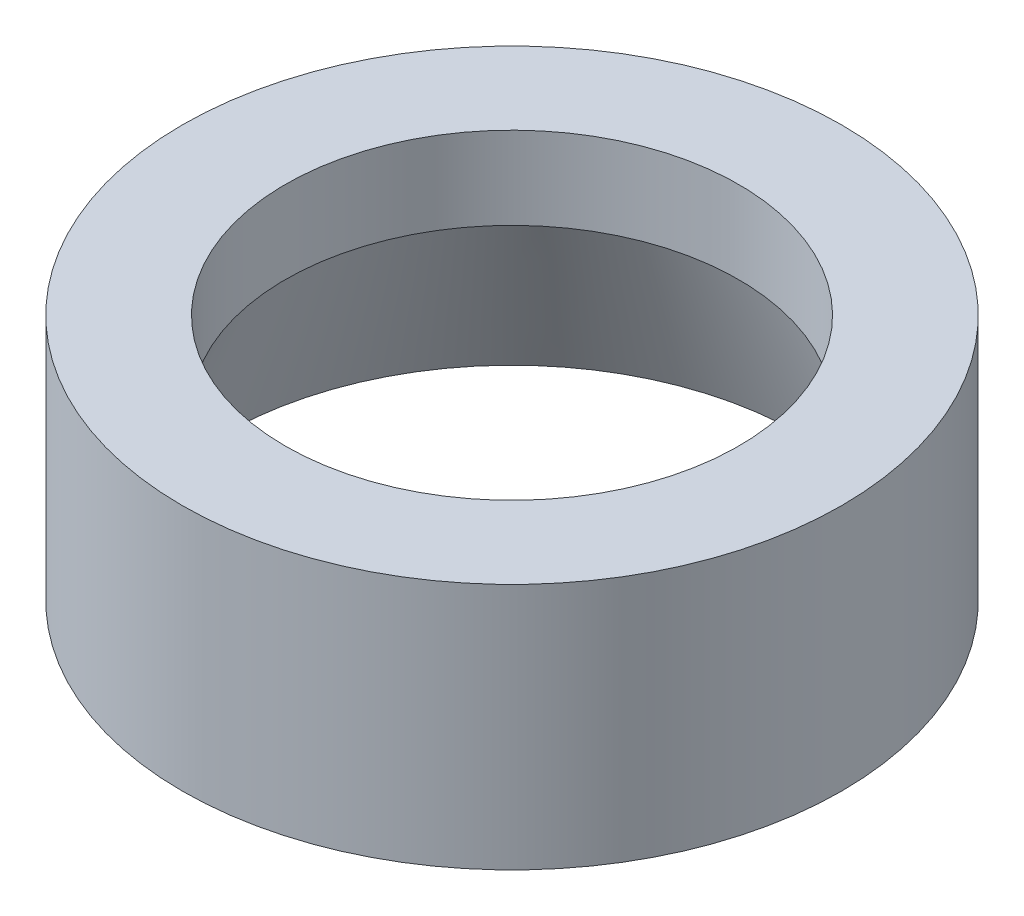
ISO-10303-21;
HEADER;
FILE_DESCRIPTION(('STEP AP214'),'2;1');
FILE_NAME('part.step','',(''),(''),'','','');
FILE_SCHEMA(('AUTOMOTIVE_DESIGN { 1 0 10303 214 1 1 1 1 }'));
ENDSEC;
DATA;
#1=APPLICATION_CONTEXT('core data for automotive mechanical design processes');
#2=APPLICATION_PROTOCOL_DEFINITION('international standard','automotive_design',2000,#1);
#3=PRODUCT_CONTEXT('',#1,'mechanical');
#4=PRODUCT('Part','Part','',(#3));
#5=PRODUCT_RELATED_PRODUCT_CATEGORY('part','',(#4));
#6=PRODUCT_DEFINITION_FORMATION('','',#4);
#7=PRODUCT_DEFINITION_CONTEXT('part definition',#1,'design');
#8=PRODUCT_DEFINITION('design','',#6,#7);
#9=PRODUCT_DEFINITION_SHAPE('','',#8);
#10=(LENGTH_UNIT() NAMED_UNIT(*) SI_UNIT(.MILLI.,.METRE.));
#11=(NAMED_UNIT(*) PLANE_ANGLE_UNIT() SI_UNIT($,.RADIAN.));
#12=(NAMED_UNIT(*) SI_UNIT($,.STERADIAN.) SOLID_ANGLE_UNIT());
#13=UNCERTAINTY_MEASURE_WITH_UNIT(LENGTH_MEASURE(1.E-05),#10,'distance_accuracy_value','');
#14=(GEOMETRIC_REPRESENTATION_CONTEXT(3) GLOBAL_UNCERTAINTY_ASSIGNED_CONTEXT((#13)) GLOBAL_UNIT_ASSIGNED_CONTEXT((#10,
#11,#12)) REPRESENTATION_CONTEXT('',''));
#15=CARTESIAN_POINT('',(0.,0.,0.));
#16=DIRECTION('',(0.,0.,1.));
#17=DIRECTION('',(1.,0.,0.));
#18=AXIS2_PLACEMENT_3D('',#15,#16,#17);
#19=CARTESIAN_POINT('',(2.75,1.5,0.));
#20=DIRECTION('',(0.,-1.,0.));
#21=DIRECTION('',(0.,0.,-1.));
#22=AXIS2_PLACEMENT_3D('',#19,#20,#21);
#23=PLANE('',#22);
#24=CARTESIAN_POINT('',(0.,1.5,0.));
#25=DIRECTION('',(0.,1.,0.));
#26=DIRECTION('',(0.,0.,1.));
#27=AXIS2_PLACEMENT_3D('',#24,#25,#26);
#28=CIRCLE('',#27,2.75);
#29=CARTESIAN_POINT('',(0.,1.5,2.75));
#30=VERTEX_POINT('',#29);
#31=EDGE_CURVE('E49',#30,#30,#28,.T.);
#32=ORIENTED_EDGE('',*,*,#31,.F.);
#33=EDGE_LOOP('',(#32));
#34=FACE_BOUND('',#33,.T.);
#35=CARTESIAN_POINT('',(0.,1.5,0.));
#36=DIRECTION('',(0.,1.,0.));
#37=DIRECTION('',(0.,0.,1.));
#38=AXIS2_PLACEMENT_3D('',#35,#36,#37);
#39=CIRCLE('',#38,4.);
#40=CARTESIAN_POINT('',(0.,1.5,4.));
#41=VERTEX_POINT('',#40);
#42=EDGE_CURVE('E10',#41,#41,#39,.T.);
#43=ORIENTED_EDGE('',*,*,#42,.T.);
#44=EDGE_LOOP('',(#43));
#45=FACE_BOUND('',#44,.T.);
#46=ADVANCED_FACE('F30',(#34,#45),#23,.F.);
#47=CARTESIAN_POINT('',(0.,1.5,0.));
#48=DIRECTION('',(0.,1.,0.));
#49=DIRECTION('',(0.,0.,1.));
#50=AXIS2_PLACEMENT_3D('',#47,#48,#49);
#51=CYLINDRICAL_SURFACE('',#50,4.);
#52=ORIENTED_EDGE('',*,*,#42,.F.);
#53=EDGE_LOOP('',(#52));
#54=FACE_BOUND('',#53,.T.);
#55=CARTESIAN_POINT('',(0.,-1.5,0.));
#56=DIRECTION('',(0.,1.,0.));
#57=DIRECTION('',(0.,0.,1.));
#58=AXIS2_PLACEMENT_3D('',#55,#56,#57);
#59=CIRCLE('',#58,4.);
#60=CARTESIAN_POINT('',(0.,-1.5,4.));
#61=VERTEX_POINT('',#60);
#62=EDGE_CURVE('E36',#61,#61,#59,.T.);
#63=ORIENTED_EDGE('',*,*,#62,.T.);
#64=EDGE_LOOP('',(#63));
#65=FACE_BOUND('',#64,.T.);
#66=ADVANCED_FACE('F56',(#54,#65),#51,.T.);
#67=CARTESIAN_POINT('',(4.,-1.5,0.));
#68=DIRECTION('',(0.,1.,0.));
#69=DIRECTION('',(0.,0.,1.));
#70=AXIS2_PLACEMENT_3D('',#67,#68,#69);
#71=PLANE('',#70);
#72=ORIENTED_EDGE('',*,*,#62,.F.);
#73=EDGE_LOOP('',(#72));
#74=FACE_BOUND('',#73,.T.);
#75=CARTESIAN_POINT('',(0.,-1.5,0.));
#76=DIRECTION('',(0.,1.,0.));
#77=DIRECTION('',(0.,0.,1.));
#78=AXIS2_PLACEMENT_3D('',#75,#76,#77);
#79=CIRCLE('',#78,3.5);
#80=CARTESIAN_POINT('',(0.,-1.5,3.5));
#81=VERTEX_POINT('',#80);
#82=EDGE_CURVE('E40',#81,#81,#79,.T.);
#83=ORIENTED_EDGE('',*,*,#82,.T.);
#84=EDGE_LOOP('',(#83));
#85=FACE_BOUND('',#84,.T.);
#86=ADVANCED_FACE('F60',(#74,#85),#71,.F.);
#87=CARTESIAN_POINT('',(0.,0.5,0.));
#88=DIRECTION('',(0.,-1.,0.));
#89=DIRECTION('',(0.,0.,-1.));
#90=AXIS2_PLACEMENT_3D('',#87,#88,#89);
#91=CONICAL_SURFACE('',#90,2.75,0.358770670270572);
#92=ORIENTED_EDGE('',*,*,#82,.F.);
#93=EDGE_LOOP('',(#92));
#94=FACE_BOUND('',#93,.T.);
#95=CARTESIAN_POINT('',(0.,0.5,0.));
#96=DIRECTION('',(0.,1.,0.));
#97=DIRECTION('',(0.,0.,1.));
#98=AXIS2_PLACEMENT_3D('',#95,#96,#97);
#99=CIRCLE('',#98,2.75);
#100=CARTESIAN_POINT('',(0.,0.5,2.75));
#101=VERTEX_POINT('',#100);
#102=EDGE_CURVE('E44',#101,#101,#99,.T.);
#103=ORIENTED_EDGE('',*,*,#102,.T.);
#104=EDGE_LOOP('',(#103));
#105=FACE_BOUND('',#104,.T.);
#106=ADVANCED_FACE('F65',(#94,#105),#91,.F.);
#107=CARTESIAN_POINT('',(0.,1.5,0.));
#108=DIRECTION('',(0.,1.,0.));
#109=DIRECTION('',(0.,0.,1.));
#110=AXIS2_PLACEMENT_3D('',#107,#108,#109);
#111=CYLINDRICAL_SURFACE('',#110,2.75);
#112=ORIENTED_EDGE('',*,*,#102,.F.);
#113=EDGE_LOOP('',(#112));
#114=FACE_BOUND('',#113,.T.);
#115=ORIENTED_EDGE('',*,*,#31,.T.);
#116=EDGE_LOOP('',(#115));
#117=FACE_BOUND('',#116,.T.);
#118=ADVANCED_FACE('F53',(#114,#117),#111,.F.);
#119=CLOSED_SHELL('',(#46,#66,#86,#106,#118));
#120=MANIFOLD_SOLID_BREP('B2',#119);
#121=ADVANCED_BREP_SHAPE_REPRESENTATION('',(#18,#120),#14);
#122=SHAPE_DEFINITION_REPRESENTATION(#9,#121);
ENDSEC;
END-ISO-10303-21;
